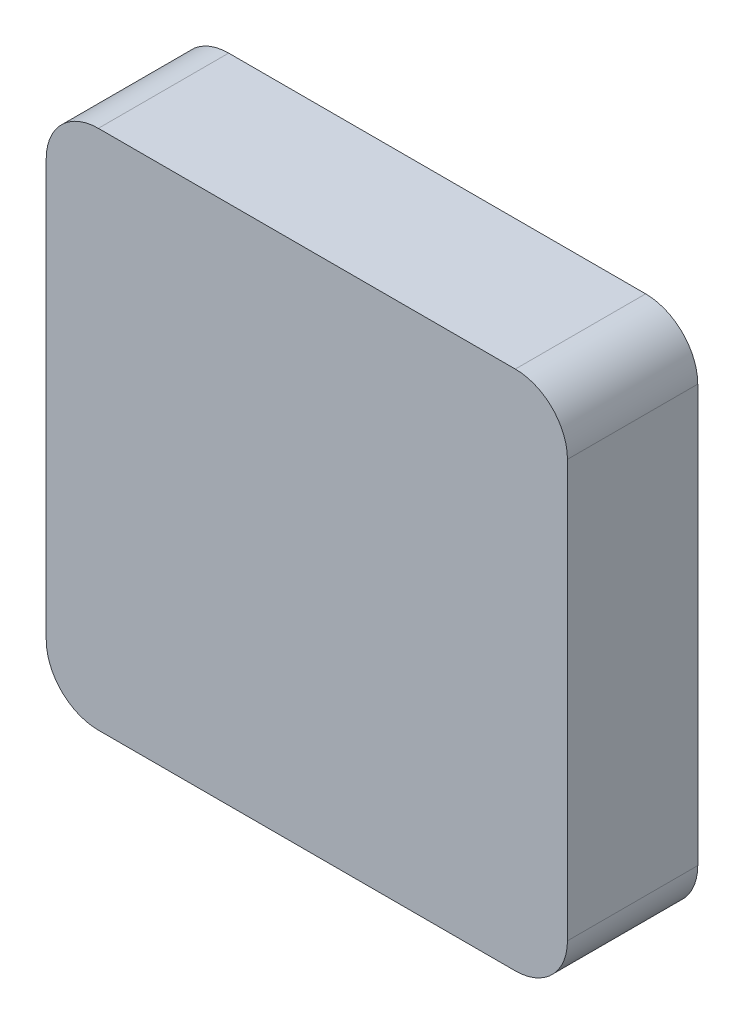
ISO-10303-21;
HEADER;
FILE_DESCRIPTION(('STEP AP214'),'2;1');
FILE_NAME('part.step','',(''),(''),'','','');
FILE_SCHEMA(('AUTOMOTIVE_DESIGN { 1 0 10303 214 1 1 1 1 }'));
ENDSEC;
DATA;
#1=APPLICATION_CONTEXT('core data for automotive mechanical design processes');
#2=APPLICATION_PROTOCOL_DEFINITION('international standard','automotive_design',2000,#1);
#3=PRODUCT_CONTEXT('',#1,'mechanical');
#4=PRODUCT('Part','Part','',(#3));
#5=PRODUCT_RELATED_PRODUCT_CATEGORY('part','',(#4));
#6=PRODUCT_DEFINITION_FORMATION('','',#4);
#7=PRODUCT_DEFINITION_CONTEXT('part definition',#1,'design');
#8=PRODUCT_DEFINITION('design','',#6,#7);
#9=PRODUCT_DEFINITION_SHAPE('','',#8);
#10=(LENGTH_UNIT() NAMED_UNIT(*) SI_UNIT(.MILLI.,.METRE.));
#11=(NAMED_UNIT(*) PLANE_ANGLE_UNIT() SI_UNIT($,.RADIAN.));
#12=(NAMED_UNIT(*) SI_UNIT($,.STERADIAN.) SOLID_ANGLE_UNIT());
#13=UNCERTAINTY_MEASURE_WITH_UNIT(LENGTH_MEASURE(1.E-05),#10,'distance_accuracy_value','');
#14=(GEOMETRIC_REPRESENTATION_CONTEXT(3) GLOBAL_UNCERTAINTY_ASSIGNED_CONTEXT((#13)) GLOBAL_UNIT_ASSIGNED_CONTEXT((#10,
#11,#12)) REPRESENTATION_CONTEXT('',''));
#15=CARTESIAN_POINT('',(0.,0.,0.));
#16=DIRECTION('',(0.,0.,1.));
#17=DIRECTION('',(1.,0.,0.));
#18=AXIS2_PLACEMENT_3D('',#15,#16,#17);
#19=CARTESIAN_POINT('',(-0.08,-0.08,0.9));
#20=DIRECTION('',(0.,0.,1.));
#21=DIRECTION('',(1.,0.,0.));
#22=AXIS2_PLACEMENT_3D('',#19,#20,#21);
#23=CYLINDRICAL_SURFACE('',#22,0.02);
#24=CARTESIAN_POINT('',(-0.08,-0.08,0.9));
#25=DIRECTION('',(0.,0.,-1.));
#26=DIRECTION('',(1.,0.,0.));
#27=AXIS2_PLACEMENT_3D('',#24,#25,#26);
#28=CIRCLE('',#27,0.02);
#29=CARTESIAN_POINT('',(-0.08,-0.1,0.9));
#30=VERTEX_POINT('',#29);
#31=CARTESIAN_POINT('',(-0.1,-0.08,0.9));
#32=VERTEX_POINT('',#31);
#33=EDGE_CURVE('E11',#30,#32,#28,.T.);
#34=ORIENTED_EDGE('',*,*,#33,.T.);
#35=DIRECTION('',(0.,0.,-1.));
#36=VECTOR('',#35,1.);
#37=CARTESIAN_POINT('',(-0.1,-0.08,0.9));
#38=LINE('',#37,#36);
#39=CARTESIAN_POINT('',(-0.1,-0.08,0.85));
#40=VERTEX_POINT('',#39);
#41=EDGE_CURVE('E26',#32,#40,#38,.T.);
#42=ORIENTED_EDGE('',*,*,#41,.T.);
#43=CARTESIAN_POINT('',(-0.08,-0.08,0.85));
#44=DIRECTION('',(0.,0.,-1.));
#45=DIRECTION('',(1.,0.,0.));
#46=AXIS2_PLACEMENT_3D('',#43,#44,#45);
#47=CIRCLE('',#46,0.02);
#48=CARTESIAN_POINT('',(-0.08,-0.1,0.85));
#49=VERTEX_POINT('',#48);
#50=EDGE_CURVE('E174',#49,#40,#47,.T.);
#51=ORIENTED_EDGE('',*,*,#50,.F.);
#52=DIRECTION('',(0.,0.,-1.));
#53=VECTOR('',#52,1.);
#54=CARTESIAN_POINT('',(-0.08,-0.1,0.9));
#55=LINE('',#54,#53);
#56=EDGE_CURVE('E148',#30,#49,#55,.T.);
#57=ORIENTED_EDGE('',*,*,#56,.F.);
#58=EDGE_LOOP('',(#34,#42,#51,#57));
#59=FACE_BOUND('',#58,.T.);
#60=ADVANCED_FACE('F17',(#59),#23,.T.);
#61=CARTESIAN_POINT('',(-0.1,0.08,0.9));
#62=DIRECTION('',(-1.,0.,0.));
#63=DIRECTION('',(0.,0.,1.));
#64=AXIS2_PLACEMENT_3D('',#61,#62,#63);
#65=PLANE('',#64);
#66=DIRECTION('',(0.,1.,0.));
#67=VECTOR('',#66,1.);
#68=CARTESIAN_POINT('',(-0.1,0.04,0.9));
#69=LINE('',#68,#67);
#70=CARTESIAN_POINT('',(-0.1,0.08,0.9));
#71=VERTEX_POINT('',#70);
#72=EDGE_CURVE('E136',#32,#71,#69,.T.);
#73=ORIENTED_EDGE('',*,*,#72,.T.);
#74=DIRECTION('',(0.,0.,-1.));
#75=VECTOR('',#74,1.);
#76=CARTESIAN_POINT('',(-0.1,0.08,0.9));
#77=LINE('',#76,#75);
#78=CARTESIAN_POINT('',(-0.1,0.08,0.85));
#79=VERTEX_POINT('',#78);
#80=EDGE_CURVE('E115',#71,#79,#77,.T.);
#81=ORIENTED_EDGE('',*,*,#80,.T.);
#82=DIRECTION('',(0.,1.,0.));
#83=VECTOR('',#82,1.);
#84=CARTESIAN_POINT('',(-0.1,-0.08,0.85));
#85=LINE('',#84,#83);
#86=EDGE_CURVE('E177',#40,#79,#85,.T.);
#87=ORIENTED_EDGE('',*,*,#86,.F.);
#88=ORIENTED_EDGE('',*,*,#41,.F.);
#89=EDGE_LOOP('',(#73,#81,#87,#88));
#90=FACE_BOUND('',#89,.T.);
#91=ADVANCED_FACE('F223',(#90),#65,.T.);
#92=CARTESIAN_POINT('',(-0.08,0.08,0.9));
#93=DIRECTION('',(0.,0.,1.));
#94=DIRECTION('',(0.,-1.,0.));
#95=AXIS2_PLACEMENT_3D('',#92,#93,#94);
#96=CYLINDRICAL_SURFACE('',#95,0.02);
#97=CARTESIAN_POINT('',(-0.08,0.08,0.9));
#98=DIRECTION('',(0.,0.,-1.));
#99=DIRECTION('',(0.,-1.,0.));
#100=AXIS2_PLACEMENT_3D('',#97,#98,#99);
#101=CIRCLE('',#100,0.02);
#102=CARTESIAN_POINT('',(-0.08,0.1,0.9));
#103=VERTEX_POINT('',#102);
#104=EDGE_CURVE('E112',#71,#103,#101,.T.);
#105=ORIENTED_EDGE('',*,*,#104,.T.);
#106=DIRECTION('',(0.,0.,1.));
#107=VECTOR('',#106,1.);
#108=CARTESIAN_POINT('',(-0.08,0.1,0.9));
#109=LINE('',#108,#107);
#110=CARTESIAN_POINT('',(-0.08,0.1,0.85));
#111=VERTEX_POINT('',#110);
#112=EDGE_CURVE('E98',#111,#103,#109,.T.);
#113=ORIENTED_EDGE('',*,*,#112,.F.);
#114=CARTESIAN_POINT('',(-0.08,0.08,0.85));
#115=DIRECTION('',(0.,0.,-1.));
#116=DIRECTION('',(0.,-1.,0.));
#117=AXIS2_PLACEMENT_3D('',#114,#115,#116);
#118=CIRCLE('',#117,0.02);
#119=EDGE_CURVE('E181',#79,#111,#118,.T.);
#120=ORIENTED_EDGE('',*,*,#119,.F.);
#121=ORIENTED_EDGE('',*,*,#80,.F.);
#122=EDGE_LOOP('',(#105,#113,#120,#121));
#123=FACE_BOUND('',#122,.T.);
#124=ADVANCED_FACE('F113',(#123),#96,.T.);
#125=CARTESIAN_POINT('',(0.08,0.1,0.9));
#126=DIRECTION('',(0.,1.,0.));
#127=DIRECTION('',(1.,0.,0.));
#128=AXIS2_PLACEMENT_3D('',#125,#126,#127);
#129=PLANE('',#128);
#130=DIRECTION('',(1.,0.,0.));
#131=VECTOR('',#130,1.);
#132=CARTESIAN_POINT('',(0.04,0.1,0.9));
#133=LINE('',#132,#131);
#134=CARTESIAN_POINT('',(0.08,0.1,0.9));
#135=VERTEX_POINT('',#134);
#136=EDGE_CURVE('E103',#103,#135,#133,.T.);
#137=ORIENTED_EDGE('',*,*,#136,.T.);
#138=DIRECTION('',(0.,0.,-1.));
#139=VECTOR('',#138,1.);
#140=CARTESIAN_POINT('',(0.08,0.1,0.9));
#141=LINE('',#140,#139);
#142=CARTESIAN_POINT('',(0.08,0.1,0.85));
#143=VERTEX_POINT('',#142);
#144=EDGE_CURVE('E109',#135,#143,#141,.T.);
#145=ORIENTED_EDGE('',*,*,#144,.T.);
#146=DIRECTION('',(1.,0.,0.));
#147=VECTOR('',#146,1.);
#148=CARTESIAN_POINT('',(-0.08,0.1,0.85));
#149=LINE('',#148,#147);
#150=EDGE_CURVE('E105',#111,#143,#149,.T.);
#151=ORIENTED_EDGE('',*,*,#150,.F.);
#152=ORIENTED_EDGE('',*,*,#112,.T.);
#153=EDGE_LOOP('',(#137,#145,#151,#152));
#154=FACE_BOUND('',#153,.T.);
#155=ADVANCED_FACE('F100',(#154),#129,.T.);
#156=CARTESIAN_POINT('',(0.,0.,0.85));
#157=DIRECTION('',(0.,0.,1.));
#158=DIRECTION('',(1.,0.,0.));
#159=AXIS2_PLACEMENT_3D('',#156,#157,#158);
#160=PLANE('',#159);
#161=ORIENTED_EDGE('',*,*,#150,.T.);
#162=CARTESIAN_POINT('',(0.08,0.08,0.85));
#163=DIRECTION('',(0.,0.,-1.));
#164=DIRECTION('',(-1.,0.,0.));
#165=AXIS2_PLACEMENT_3D('',#162,#163,#164);
#166=CIRCLE('',#165,0.02);
#167=CARTESIAN_POINT('',(0.1,0.08,0.85));
#168=VERTEX_POINT('',#167);
#169=EDGE_CURVE('E139',#143,#168,#166,.T.);
#170=ORIENTED_EDGE('',*,*,#169,.T.);
#171=DIRECTION('',(0.,-1.,0.));
#172=VECTOR('',#171,1.);
#173=CARTESIAN_POINT('',(0.1,0.08,0.85));
#174=LINE('',#173,#172);
#175=CARTESIAN_POINT('',(0.1,-0.08,0.85));
#176=VERTEX_POINT('',#175);
#177=EDGE_CURVE('E143',#168,#176,#174,.T.);
#178=ORIENTED_EDGE('',*,*,#177,.T.);
#179=CARTESIAN_POINT('',(0.08,-0.08,0.85));
#180=DIRECTION('',(0.,0.,-1.));
#181=DIRECTION('',(0.,1.,0.));
#182=AXIS2_PLACEMENT_3D('',#179,#180,#181);
#183=CIRCLE('',#182,0.02);
#184=CARTESIAN_POINT('',(0.08,-0.1,0.85));
#185=VERTEX_POINT('',#184);
#186=EDGE_CURVE('E163',#176,#185,#183,.T.);
#187=ORIENTED_EDGE('',*,*,#186,.T.);
#188=DIRECTION('',(-1.,0.,0.));
#189=VECTOR('',#188,1.);
#190=CARTESIAN_POINT('',(0.08,-0.1,0.85));
#191=LINE('',#190,#189);
#192=EDGE_CURVE('E166',#185,#49,#191,.T.);
#193=ORIENTED_EDGE('',*,*,#192,.T.);
#194=ORIENTED_EDGE('',*,*,#50,.T.);
#195=ORIENTED_EDGE('',*,*,#86,.T.);
#196=ORIENTED_EDGE('',*,*,#119,.T.);
#197=EDGE_LOOP('',(#161,#170,#178,#187,#193,#194,#195,#196));
#198=FACE_BOUND('',#197,.T.);
#199=ADVANCED_FACE('F208',(#198),#160,.F.);
#200=CARTESIAN_POINT('',(0.08,0.08,0.9));
#201=DIRECTION('',(0.,0.,1.));
#202=DIRECTION('',(-1.,0.,0.));
#203=AXIS2_PLACEMENT_3D('',#200,#201,#202);
#204=CYLINDRICAL_SURFACE('',#203,0.02);
#205=CARTESIAN_POINT('',(0.08,0.08,0.9));
#206=DIRECTION('',(0.,0.,-1.));
#207=DIRECTION('',(-1.,0.,0.));
#208=AXIS2_PLACEMENT_3D('',#205,#206,#207);
#209=CIRCLE('',#208,0.02);
#210=CARTESIAN_POINT('',(0.1,0.08,0.9));
#211=VERTEX_POINT('',#210);
#212=EDGE_CURVE('E123',#135,#211,#209,.T.);
#213=ORIENTED_EDGE('',*,*,#212,.T.);
#214=DIRECTION('',(0.,0.,-1.));
#215=VECTOR('',#214,1.);
#216=CARTESIAN_POINT('',(0.1,0.08,0.9));
#217=LINE('',#216,#215);
#218=EDGE_CURVE('E186',#211,#168,#217,.T.);
#219=ORIENTED_EDGE('',*,*,#218,.T.);
#220=ORIENTED_EDGE('',*,*,#169,.F.);
#221=ORIENTED_EDGE('',*,*,#144,.F.);
#222=EDGE_LOOP('',(#213,#219,#220,#221));
#223=FACE_BOUND('',#222,.T.);
#224=ADVANCED_FACE('F210',(#223),#204,.T.);
#225=CARTESIAN_POINT('',(0.1,-0.08,0.9));
#226=DIRECTION('',(1.,0.,0.));
#227=DIRECTION('',(0.,1.,0.));
#228=AXIS2_PLACEMENT_3D('',#225,#226,#227);
#229=PLANE('',#228);
#230=DIRECTION('',(0.,-1.,0.));
#231=VECTOR('',#230,1.);
#232=CARTESIAN_POINT('',(0.1,-0.04,0.9));
#233=LINE('',#232,#231);
#234=CARTESIAN_POINT('',(0.1,-0.08,0.9));
#235=VERTEX_POINT('',#234);
#236=EDGE_CURVE('E170',#211,#235,#233,.T.);
#237=ORIENTED_EDGE('',*,*,#236,.T.);
#238=DIRECTION('',(0.,0.,-1.));
#239=VECTOR('',#238,1.);
#240=CARTESIAN_POINT('',(0.1,-0.08,0.9));
#241=LINE('',#240,#239);
#242=EDGE_CURVE('E147',#235,#176,#241,.T.);
#243=ORIENTED_EDGE('',*,*,#242,.T.);
#244=ORIENTED_EDGE('',*,*,#177,.F.);
#245=ORIENTED_EDGE('',*,*,#218,.F.);
#246=EDGE_LOOP('',(#237,#243,#244,#245));
#247=FACE_BOUND('',#246,.T.);
#248=ADVANCED_FACE('F202',(#247),#229,.T.);
#249=CARTESIAN_POINT('',(0.08,-0.08,0.9));
#250=DIRECTION('',(0.,0.,1.));
#251=DIRECTION('',(0.,1.,0.));
#252=AXIS2_PLACEMENT_3D('',#249,#250,#251);
#253=CYLINDRICAL_SURFACE('',#252,0.02);
#254=CARTESIAN_POINT('',(0.08,-0.08,0.9));
#255=DIRECTION('',(0.,0.,-1.));
#256=DIRECTION('',(0.,1.,0.));
#257=AXIS2_PLACEMENT_3D('',#254,#255,#256);
#258=CIRCLE('',#257,0.02);
#259=CARTESIAN_POINT('',(0.08,-0.1,0.9));
#260=VERTEX_POINT('',#259);
#261=EDGE_CURVE('E144',#235,#260,#258,.T.);
#262=ORIENTED_EDGE('',*,*,#261,.T.);
#263=DIRECTION('',(0.,0.,-1.));
#264=VECTOR('',#263,1.);
#265=CARTESIAN_POINT('',(0.08,-0.1,0.9));
#266=LINE('',#265,#264);
#267=EDGE_CURVE('E131',#260,#185,#266,.T.);
#268=ORIENTED_EDGE('',*,*,#267,.T.);
#269=ORIENTED_EDGE('',*,*,#186,.F.);
#270=ORIENTED_EDGE('',*,*,#242,.F.);
#271=EDGE_LOOP('',(#262,#268,#269,#270));
#272=FACE_BOUND('',#271,.T.);
#273=ADVANCED_FACE('F206',(#272),#253,.T.);
#274=CARTESIAN_POINT('',(-0.08,-0.1,0.9));
#275=DIRECTION('',(0.,-1.,0.));
#276=DIRECTION('',(0.,0.,-1.));
#277=AXIS2_PLACEMENT_3D('',#274,#275,#276);
#278=PLANE('',#277);
#279=DIRECTION('',(-1.,0.,0.));
#280=VECTOR('',#279,1.);
#281=CARTESIAN_POINT('',(-0.04,-0.1,0.9));
#282=LINE('',#281,#280);
#283=EDGE_CURVE('E150',#260,#30,#282,.T.);
#284=ORIENTED_EDGE('',*,*,#283,.T.);
#285=ORIENTED_EDGE('',*,*,#56,.T.);
#286=ORIENTED_EDGE('',*,*,#192,.F.);
#287=ORIENTED_EDGE('',*,*,#267,.F.);
#288=EDGE_LOOP('',(#284,#285,#286,#287));
#289=FACE_BOUND('',#288,.T.);
#290=ADVANCED_FACE('F232',(#289),#278,.T.);
#291=CARTESIAN_POINT('',(0.,0.,0.9));
#292=DIRECTION('',(0.,0.,1.));
#293=DIRECTION('',(1.,0.,0.));
#294=AXIS2_PLACEMENT_3D('',#291,#292,#293);
#295=PLANE('',#294);
#296=ORIENTED_EDGE('',*,*,#212,.F.);
#297=ORIENTED_EDGE('',*,*,#136,.F.);
#298=ORIENTED_EDGE('',*,*,#104,.F.);
#299=ORIENTED_EDGE('',*,*,#72,.F.);
#300=ORIENTED_EDGE('',*,*,#33,.F.);
#301=ORIENTED_EDGE('',*,*,#283,.F.);
#302=ORIENTED_EDGE('',*,*,#261,.F.);
#303=ORIENTED_EDGE('',*,*,#236,.F.);
#304=EDGE_LOOP('',(#296,#297,#298,#299,#300,#301,#302,#303));
#305=FACE_BOUND('',#304,.T.);
#306=ADVANCED_FACE('F120',(#305),#295,.T.);
#307=CLOSED_SHELL('',(#60,#91,#124,#155,#199,#224,#248,#273,#290,#306));
#308=MANIFOLD_SOLID_BREP('B1',#307);
#309=ADVANCED_BREP_SHAPE_REPRESENTATION('',(#18,#308),#14);
#310=SHAPE_DEFINITION_REPRESENTATION(#9,#309);
ENDSEC;
END-ISO-10303-21;
